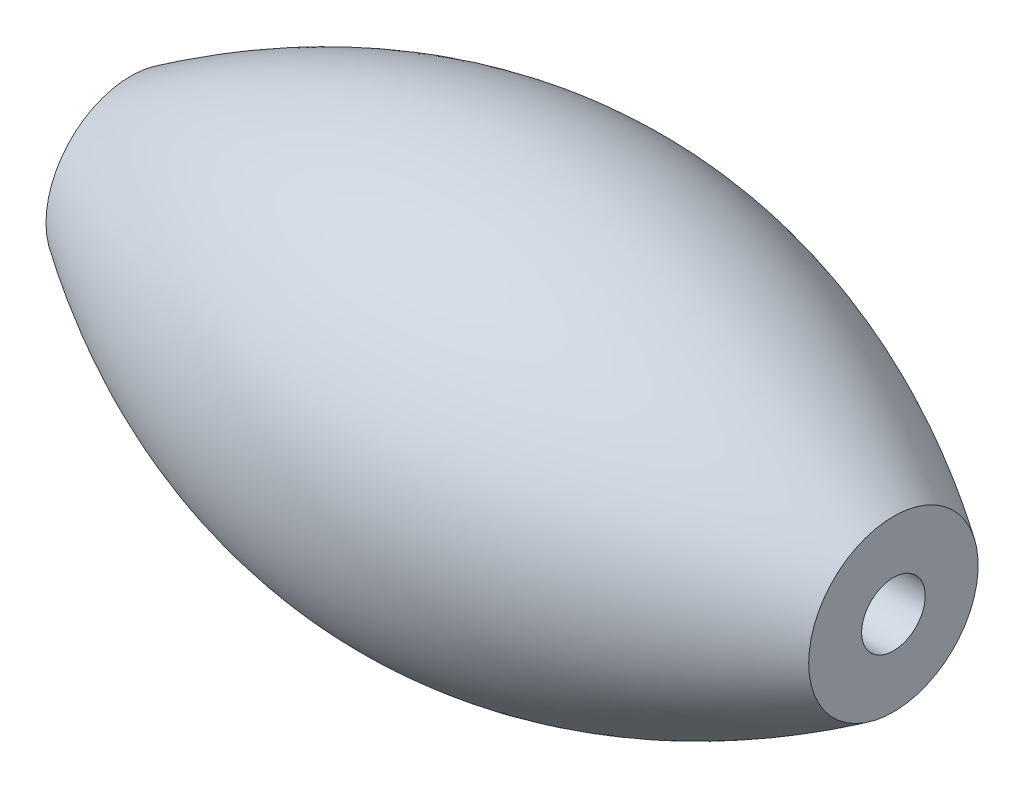
ISO-10303-21;
HEADER;
FILE_DESCRIPTION(('STEP AP214'),'2;1');
FILE_NAME('part.step','',(''),(''),'','','');
FILE_SCHEMA(('AUTOMOTIVE_DESIGN { 1 0 10303 214 1 1 1 1 }'));
ENDSEC;
DATA;
#1=APPLICATION_CONTEXT('core data for automotive mechanical design processes');
#2=APPLICATION_PROTOCOL_DEFINITION('international standard','automotive_design',2000,#1);
#3=PRODUCT_CONTEXT('',#1,'mechanical');
#4=PRODUCT('Part','Part','',(#3));
#5=PRODUCT_RELATED_PRODUCT_CATEGORY('part','',(#4));
#6=PRODUCT_DEFINITION_FORMATION('','',#4);
#7=PRODUCT_DEFINITION_CONTEXT('part definition',#1,'design');
#8=PRODUCT_DEFINITION('design','',#6,#7);
#9=PRODUCT_DEFINITION_SHAPE('','',#8);
#10=(LENGTH_UNIT() NAMED_UNIT(*) SI_UNIT(.MILLI.,.METRE.));
#11=(NAMED_UNIT(*) PLANE_ANGLE_UNIT() SI_UNIT($,.RADIAN.));
#12=(NAMED_UNIT(*) SI_UNIT($,.STERADIAN.) SOLID_ANGLE_UNIT());
#13=UNCERTAINTY_MEASURE_WITH_UNIT(LENGTH_MEASURE(1.E-05),#10,'distance_accuracy_value','');
#14=(GEOMETRIC_REPRESENTATION_CONTEXT(3) GLOBAL_UNCERTAINTY_ASSIGNED_CONTEXT((#13)) GLOBAL_UNIT_ASSIGNED_CONTEXT((#10,
#11,#12)) REPRESENTATION_CONTEXT('',''));
#15=CARTESIAN_POINT('',(0.,0.,0.));
#16=DIRECTION('',(0.,0.,1.));
#17=DIRECTION('',(1.,0.,0.));
#18=AXIS2_PLACEMENT_3D('',#15,#16,#17);
#19=CARTESIAN_POINT('',(-37.6574992377359,4.,0.));
#20=DIRECTION('',(1.,0.,0.));
#21=DIRECTION('',(0.,0.,-1.));
#22=AXIS2_PLACEMENT_3D('',#19,#20,#21);
#23=PLANE('',#22);
#24=CARTESIAN_POINT('',(-37.6574992377359,0.,0.));
#25=DIRECTION('',(1.,0.,0.));
#26=DIRECTION('',(0.,0.,-1.));
#27=AXIS2_PLACEMENT_3D('',#24,#25,#26);
#28=CIRCLE('',#27,1.5);
#29=CARTESIAN_POINT('',(-37.6574992377359,0.,-1.5));
#30=VERTEX_POINT('',#29);
#31=EDGE_CURVE('E42',#30,#30,#28,.T.);
#32=ORIENTED_EDGE('',*,*,#31,.T.);
#33=EDGE_LOOP('',(#32));
#34=FACE_BOUND('',#33,.T.);
#35=CARTESIAN_POINT('',(-37.6574992377359,0.,0.));
#36=DIRECTION('',(-1.,0.,0.));
#37=DIRECTION('',(0.,0.,1.));
#38=AXIS2_PLACEMENT_3D('',#35,#36,#37);
#39=CIRCLE('',#38,4.);
#40=CARTESIAN_POINT('',(-37.6574992377359,0.,4.));
#41=VERTEX_POINT('',#40);
#42=EDGE_CURVE('E10',#41,#41,#39,.T.);
#43=ORIENTED_EDGE('',*,*,#42,.T.);
#44=EDGE_LOOP('',(#43));
#45=FACE_BOUND('',#44,.T.);
#46=ADVANCED_FACE('F32',(#34,#45),#23,.F.);
#47=CARTESIAN_POINT('',(-1.65749923773593,4.,0.));
#48=CARTESIAN_POINT('',(-19.6574992377359,16.,0.));
#49=CARTESIAN_POINT('',(-37.6574992377359,4.,0.));
#50=B_SPLINE_CURVE_WITH_KNOTS('',2,(#47,#48,#49),.UNSPECIFIED.,.F.,.F.,(3,3),(0.,1.),.UNSPECIFIED.);
#51=CARTESIAN_POINT('',(-37.6574992377359,0.,0.));
#52=DIRECTION('',(-1.,0.,0.));
#53=AXIS1_PLACEMENT('',#51,#52);
#54=SURFACE_OF_REVOLUTION('',#50,#53);
#55=ORIENTED_EDGE('',*,*,#42,.F.);
#56=EDGE_LOOP('',(#55));
#57=FACE_BOUND('',#56,.T.);
#58=CARTESIAN_POINT('',(-1.65749923773593,0.,0.));
#59=DIRECTION('',(-1.,0.,0.));
#60=DIRECTION('',(0.,0.,1.));
#61=AXIS2_PLACEMENT_3D('',#58,#59,#60);
#62=CIRCLE('',#61,4.);
#63=CARTESIAN_POINT('',(-1.65749923773593,0.,4.));
#64=VERTEX_POINT('',#63);
#65=EDGE_CURVE('E38',#64,#64,#62,.T.);
#66=ORIENTED_EDGE('',*,*,#65,.T.);
#67=EDGE_LOOP('',(#66));
#68=FACE_BOUND('',#67,.T.);
#69=ADVANCED_FACE('F56',(#57,#68),#54,.T.);
#70=CARTESIAN_POINT('',(-1.65749923773593,0.,0.));
#71=DIRECTION('',(-1.,0.,0.));
#72=DIRECTION('',(0.,0.,1.));
#73=AXIS2_PLACEMENT_3D('',#70,#71,#72);
#74=PLANE('',#73);
#75=CARTESIAN_POINT('',(-1.65749923773593,0.,0.));
#76=DIRECTION('',(1.,0.,0.));
#77=DIRECTION('',(0.,0.,-1.));
#78=AXIS2_PLACEMENT_3D('',#75,#76,#77);
#79=CIRCLE('',#78,1.5);
#80=CARTESIAN_POINT('',(-1.65749923773593,0.,-1.5));
#81=VERTEX_POINT('',#80);
#82=EDGE_CURVE('E46',#81,#81,#79,.T.);
#83=ORIENTED_EDGE('',*,*,#82,.F.);
#84=EDGE_LOOP('',(#83));
#85=FACE_BOUND('',#84,.T.);
#86=ORIENTED_EDGE('',*,*,#65,.F.);
#87=EDGE_LOOP('',(#86));
#88=FACE_BOUND('',#87,.T.);
#89=ADVANCED_FACE('F59',(#85,#88),#74,.F.);
#90=CARTESIAN_POINT('',(-46.6574992377359,0.,0.));
#91=DIRECTION('',(1.,0.,0.));
#92=DIRECTION('',(0.,0.,-1.));
#93=AXIS2_PLACEMENT_3D('',#90,#91,#92);
#94=CYLINDRICAL_SURFACE('',#93,1.5);
#95=ORIENTED_EDGE('',*,*,#82,.T.);
#96=EDGE_LOOP('',(#95));
#97=FACE_BOUND('',#96,.T.);
#98=ORIENTED_EDGE('',*,*,#31,.F.);
#99=EDGE_LOOP('',(#98));
#100=FACE_BOUND('',#99,.T.);
#101=ADVANCED_FACE('F63',(#97,#100),#94,.F.);
#102=CLOSED_SHELL('',(#46,#69,#89,#101));
#103=MANIFOLD_SOLID_BREP('B2',#102);
#104=ADVANCED_BREP_SHAPE_REPRESENTATION('',(#18,#103),#14);
#105=SHAPE_DEFINITION_REPRESENTATION(#9,#104);
ENDSEC;
END-ISO-10303-21;
